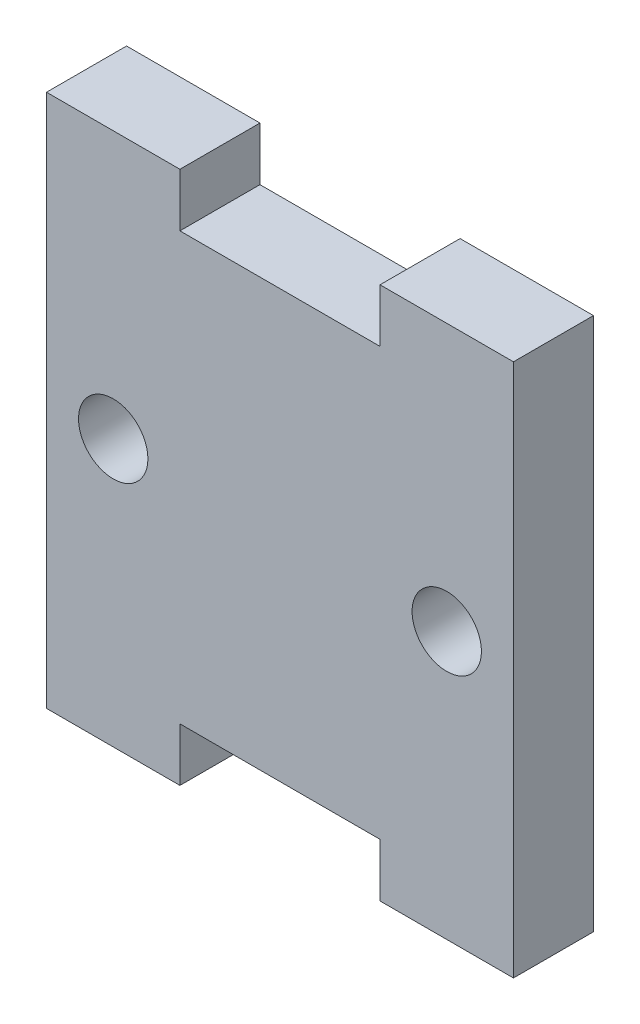
ISO-10303-21;
HEADER;
FILE_DESCRIPTION(('STEP AP214'),'2;1');
FILE_NAME('part.step','',(''),(''),'','','');
FILE_SCHEMA(('AUTOMOTIVE_DESIGN { 1 0 10303 214 1 1 1 1 }'));
ENDSEC;
DATA;
#1=APPLICATION_CONTEXT('core data for automotive mechanical design processes');
#2=APPLICATION_PROTOCOL_DEFINITION('international standard','automotive_design',2000,#1);
#3=PRODUCT_CONTEXT('',#1,'mechanical');
#4=PRODUCT('Part','Part','',(#3));
#5=PRODUCT_RELATED_PRODUCT_CATEGORY('part','',(#4));
#6=PRODUCT_DEFINITION_FORMATION('','',#4);
#7=PRODUCT_DEFINITION_CONTEXT('part definition',#1,'design');
#8=PRODUCT_DEFINITION('design','',#6,#7);
#9=PRODUCT_DEFINITION_SHAPE('','',#8);
#10=(LENGTH_UNIT() NAMED_UNIT(*) SI_UNIT(.MILLI.,.METRE.));
#11=(NAMED_UNIT(*) PLANE_ANGLE_UNIT() SI_UNIT($,.RADIAN.));
#12=(NAMED_UNIT(*) SI_UNIT($,.STERADIAN.) SOLID_ANGLE_UNIT());
#13=UNCERTAINTY_MEASURE_WITH_UNIT(LENGTH_MEASURE(1.E-05),#10,'distance_accuracy_value','');
#14=(GEOMETRIC_REPRESENTATION_CONTEXT(3) GLOBAL_UNCERTAINTY_ASSIGNED_CONTEXT((#13)) GLOBAL_UNIT_ASSIGNED_CONTEXT((#10,
#11,#12)) REPRESENTATION_CONTEXT('',''));
#15=CARTESIAN_POINT('',(0.,0.,0.));
#16=DIRECTION('',(0.,0.,1.));
#17=DIRECTION('',(1.,0.,0.));
#18=AXIS2_PLACEMENT_3D('',#15,#16,#17);
#19=CARTESIAN_POINT('',(-17.5,0.,6.));
#20=DIRECTION('',(-1.,0.,0.));
#21=DIRECTION('',(0.,0.,1.));
#22=AXIS2_PLACEMENT_3D('',#19,#20,#21);
#23=PLANE('',#22);
#24=DIRECTION('',(0.,1.,0.));
#25=VECTOR('',#24,1.);
#26=CARTESIAN_POINT('',(-17.5,0.,0.));
#27=LINE('',#26,#25);
#28=CARTESIAN_POINT('',(-17.5,-20.,0.));
#29=VERTEX_POINT('',#28);
#30=CARTESIAN_POINT('',(-17.5,20.,0.));
#31=VERTEX_POINT('',#30);
#32=EDGE_CURVE('E165',#29,#31,#27,.T.);
#33=ORIENTED_EDGE('',*,*,#32,.F.);
#34=DIRECTION('',(0.,0.,-1.));
#35=VECTOR('',#34,1.);
#36=CARTESIAN_POINT('',(-17.5,-20.,6.));
#37=LINE('',#36,#35);
#38=CARTESIAN_POINT('',(-17.5,-20.,6.));
#39=VERTEX_POINT('',#38);
#40=EDGE_CURVE('E11',#39,#29,#37,.T.);
#41=ORIENTED_EDGE('',*,*,#40,.F.);
#42=DIRECTION('',(0.,1.,0.));
#43=VECTOR('',#42,1.);
#44=CARTESIAN_POINT('',(-17.5,0.,6.));
#45=LINE('',#44,#43);
#46=CARTESIAN_POINT('',(-17.5,20.,6.));
#47=VERTEX_POINT('',#46);
#48=EDGE_CURVE('E201',#39,#47,#45,.T.);
#49=ORIENTED_EDGE('',*,*,#48,.T.);
#50=DIRECTION('',(0.,0.,-1.));
#51=VECTOR('',#50,1.);
#52=CARTESIAN_POINT('',(-17.5,20.,6.));
#53=LINE('',#52,#51);
#54=EDGE_CURVE('E103',#47,#31,#53,.T.);
#55=ORIENTED_EDGE('',*,*,#54,.T.);
#56=EDGE_LOOP('',(#33,#41,#49,#55));
#57=FACE_BOUND('',#56,.T.);
#58=ADVANCED_FACE('F41',(#57),#23,.T.);
#59=CARTESIAN_POINT('',(0.,-20.,6.));
#60=DIRECTION('',(0.,-1.,0.));
#61=DIRECTION('',(0.,0.,-1.));
#62=AXIS2_PLACEMENT_3D('',#59,#60,#61);
#63=PLANE('',#62);
#64=DIRECTION('',(-1.,0.,0.));
#65=VECTOR('',#64,1.);
#66=CARTESIAN_POINT('',(0.,-20.,0.));
#67=LINE('',#66,#65);
#68=CARTESIAN_POINT('',(-7.5,-20.,0.));
#69=VERTEX_POINT('',#68);
#70=EDGE_CURVE('E168',#69,#29,#67,.T.);
#71=ORIENTED_EDGE('',*,*,#70,.F.);
#72=DIRECTION('',(0.,0.,-1.));
#73=VECTOR('',#72,1.);
#74=CARTESIAN_POINT('',(-7.5,-20.,6.));
#75=LINE('',#74,#73);
#76=CARTESIAN_POINT('',(-7.5,-20.,6.));
#77=VERTEX_POINT('',#76);
#78=EDGE_CURVE('E49',#77,#69,#75,.T.);
#79=ORIENTED_EDGE('',*,*,#78,.F.);
#80=DIRECTION('',(-1.,0.,0.));
#81=VECTOR('',#80,1.);
#82=CARTESIAN_POINT('',(0.,-20.,6.));
#83=LINE('',#82,#81);
#84=EDGE_CURVE('E233',#77,#39,#83,.T.);
#85=ORIENTED_EDGE('',*,*,#84,.T.);
#86=ORIENTED_EDGE('',*,*,#40,.T.);
#87=EDGE_LOOP('',(#71,#79,#85,#86));
#88=FACE_BOUND('',#87,.T.);
#89=ADVANCED_FACE('F232',(#88),#63,.T.);
#90=CARTESIAN_POINT('',(-7.5,0.,6.));
#91=DIRECTION('',(-1.,0.,0.));
#92=DIRECTION('',(0.,0.,1.));
#93=AXIS2_PLACEMENT_3D('',#90,#91,#92);
#94=PLANE('',#93);
#95=DIRECTION('',(0.,1.,0.));
#96=VECTOR('',#95,1.);
#97=CARTESIAN_POINT('',(-7.5,0.,0.));
#98=LINE('',#97,#96);
#99=CARTESIAN_POINT('',(-7.5,-16.,0.));
#100=VERTEX_POINT('',#99);
#101=EDGE_CURVE('E171',#69,#100,#98,.T.);
#102=ORIENTED_EDGE('',*,*,#101,.T.);
#103=DIRECTION('',(0.,0.,-1.));
#104=VECTOR('',#103,1.);
#105=CARTESIAN_POINT('',(-7.5,-16.,6.));
#106=LINE('',#105,#104);
#107=CARTESIAN_POINT('',(-7.5,-16.,6.));
#108=VERTEX_POINT('',#107);
#109=EDGE_CURVE('E216',#108,#100,#106,.T.);
#110=ORIENTED_EDGE('',*,*,#109,.F.);
#111=DIRECTION('',(0.,1.,0.));
#112=VECTOR('',#111,1.);
#113=CARTESIAN_POINT('',(-7.5,0.,6.));
#114=LINE('',#113,#112);
#115=EDGE_CURVE('E223',#77,#108,#114,.T.);
#116=ORIENTED_EDGE('',*,*,#115,.F.);
#117=ORIENTED_EDGE('',*,*,#78,.T.);
#118=EDGE_LOOP('',(#102,#110,#116,#117));
#119=FACE_BOUND('',#118,.T.);
#120=ADVANCED_FACE('F221',(#119),#94,.F.);
#121=CARTESIAN_POINT('',(0.,-16.,6.));
#122=DIRECTION('',(0.,1.,0.));
#123=DIRECTION('',(0.,0.,1.));
#124=AXIS2_PLACEMENT_3D('',#121,#122,#123);
#125=PLANE('',#124);
#126=DIRECTION('',(1.,0.,0.));
#127=VECTOR('',#126,1.);
#128=CARTESIAN_POINT('',(0.,-16.,0.));
#129=LINE('',#128,#127);
#130=CARTESIAN_POINT('',(7.5,-16.,0.));
#131=VERTEX_POINT('',#130);
#132=EDGE_CURVE('E173',#100,#131,#129,.T.);
#133=ORIENTED_EDGE('',*,*,#132,.T.);
#134=DIRECTION('',(0.,0.,-1.));
#135=VECTOR('',#134,1.);
#136=CARTESIAN_POINT('',(7.5,-16.,6.));
#137=LINE('',#136,#135);
#138=CARTESIAN_POINT('',(7.5,-16.,6.));
#139=VERTEX_POINT('',#138);
#140=EDGE_CURVE('E214',#139,#131,#137,.T.);
#141=ORIENTED_EDGE('',*,*,#140,.F.);
#142=DIRECTION('',(1.,0.,0.));
#143=VECTOR('',#142,1.);
#144=CARTESIAN_POINT('',(0.,-16.,6.));
#145=LINE('',#144,#143);
#146=EDGE_CURVE('E239',#108,#139,#145,.T.);
#147=ORIENTED_EDGE('',*,*,#146,.F.);
#148=ORIENTED_EDGE('',*,*,#109,.T.);
#149=EDGE_LOOP('',(#133,#141,#147,#148));
#150=FACE_BOUND('',#149,.T.);
#151=ADVANCED_FACE('F280',(#150),#125,.F.);
#152=CARTESIAN_POINT('',(7.50000000000001,0.,6.));
#153=DIRECTION('',(-1.,0.,0.));
#154=DIRECTION('',(0.,-1.,0.));
#155=AXIS2_PLACEMENT_3D('',#152,#153,#154);
#156=PLANE('',#155);
#157=DIRECTION('',(0.,1.,0.));
#158=VECTOR('',#157,1.);
#159=CARTESIAN_POINT('',(7.50000000000001,0.,0.));
#160=LINE('',#159,#158);
#161=CARTESIAN_POINT('',(7.5,-20.,0.));
#162=VERTEX_POINT('',#161);
#163=EDGE_CURVE('E176',#162,#131,#160,.T.);
#164=ORIENTED_EDGE('',*,*,#163,.F.);
#165=DIRECTION('',(0.,0.,-1.));
#166=VECTOR('',#165,1.);
#167=CARTESIAN_POINT('',(7.5,-20.,6.));
#168=LINE('',#167,#166);
#169=CARTESIAN_POINT('',(7.5,-20.,6.));
#170=VERTEX_POINT('',#169);
#171=EDGE_CURVE('E212',#170,#162,#168,.T.);
#172=ORIENTED_EDGE('',*,*,#171,.F.);
#173=DIRECTION('',(0.,1.,0.));
#174=VECTOR('',#173,1.);
#175=CARTESIAN_POINT('',(7.50000000000001,0.,6.));
#176=LINE('',#175,#174);
#177=EDGE_CURVE('E241',#170,#139,#176,.T.);
#178=ORIENTED_EDGE('',*,*,#177,.T.);
#179=ORIENTED_EDGE('',*,*,#140,.T.);
#180=EDGE_LOOP('',(#164,#172,#178,#179));
#181=FACE_BOUND('',#180,.T.);
#182=ADVANCED_FACE('F285',(#181),#156,.T.);
#183=CARTESIAN_POINT('',(0.,-20.,6.));
#184=DIRECTION('',(0.,1.,0.));
#185=DIRECTION('',(0.,0.,1.));
#186=AXIS2_PLACEMENT_3D('',#183,#184,#185);
#187=PLANE('',#186);
#188=DIRECTION('',(1.,0.,0.));
#189=VECTOR('',#188,1.);
#190=CARTESIAN_POINT('',(0.,-20.,0.));
#191=LINE('',#190,#189);
#192=CARTESIAN_POINT('',(17.5,-20.,0.));
#193=VERTEX_POINT('',#192);
#194=EDGE_CURVE('E179',#162,#193,#191,.T.);
#195=ORIENTED_EDGE('',*,*,#194,.T.);
#196=DIRECTION('',(0.,0.,-1.));
#197=VECTOR('',#196,1.);
#198=CARTESIAN_POINT('',(17.5,-20.,6.));
#199=LINE('',#198,#197);
#200=CARTESIAN_POINT('',(17.5,-20.,6.));
#201=VERTEX_POINT('',#200);
#202=EDGE_CURVE('E209',#201,#193,#199,.T.);
#203=ORIENTED_EDGE('',*,*,#202,.F.);
#204=DIRECTION('',(1.,0.,0.));
#205=VECTOR('',#204,1.);
#206=CARTESIAN_POINT('',(0.,-20.,6.));
#207=LINE('',#206,#205);
#208=EDGE_CURVE('E244',#170,#201,#207,.T.);
#209=ORIENTED_EDGE('',*,*,#208,.F.);
#210=ORIENTED_EDGE('',*,*,#171,.T.);
#211=EDGE_LOOP('',(#195,#203,#209,#210));
#212=FACE_BOUND('',#211,.T.);
#213=ADVANCED_FACE('F289',(#212),#187,.F.);
#214=CARTESIAN_POINT('',(17.5,0.,6.));
#215=DIRECTION('',(-1.,0.,0.));
#216=DIRECTION('',(0.,0.,1.));
#217=AXIS2_PLACEMENT_3D('',#214,#215,#216);
#218=PLANE('',#217);
#219=DIRECTION('',(0.,1.,0.));
#220=VECTOR('',#219,1.);
#221=CARTESIAN_POINT('',(17.5,0.,0.));
#222=LINE('',#221,#220);
#223=CARTESIAN_POINT('',(17.5,20.,0.));
#224=VERTEX_POINT('',#223);
#225=EDGE_CURVE('E181',#193,#224,#222,.T.);
#226=ORIENTED_EDGE('',*,*,#225,.T.);
#227=DIRECTION('',(0.,0.,-1.));
#228=VECTOR('',#227,1.);
#229=CARTESIAN_POINT('',(17.5,20.,6.));
#230=LINE('',#229,#228);
#231=CARTESIAN_POINT('',(17.5,20.,6.));
#232=VERTEX_POINT('',#231);
#233=EDGE_CURVE('E207',#232,#224,#230,.T.);
#234=ORIENTED_EDGE('',*,*,#233,.F.);
#235=DIRECTION('',(0.,1.,0.));
#236=VECTOR('',#235,1.);
#237=CARTESIAN_POINT('',(17.5,0.,6.));
#238=LINE('',#237,#236);
#239=EDGE_CURVE('E246',#201,#232,#238,.T.);
#240=ORIENTED_EDGE('',*,*,#239,.F.);
#241=ORIENTED_EDGE('',*,*,#202,.T.);
#242=EDGE_LOOP('',(#226,#234,#240,#241));
#243=FACE_BOUND('',#242,.T.);
#244=ADVANCED_FACE('F259',(#243),#218,.F.);
#245=CARTESIAN_POINT('',(0.,20.,6.));
#246=DIRECTION('',(0.,1.,0.));
#247=DIRECTION('',(-1.,0.,0.));
#248=AXIS2_PLACEMENT_3D('',#245,#246,#247);
#249=PLANE('',#248);
#250=DIRECTION('',(1.,0.,0.));
#251=VECTOR('',#250,1.);
#252=CARTESIAN_POINT('',(0.,20.,0.));
#253=LINE('',#252,#251);
#254=CARTESIAN_POINT('',(7.49999999999999,20.,0.));
#255=VERTEX_POINT('',#254);
#256=EDGE_CURVE('E184',#255,#224,#253,.T.);
#257=ORIENTED_EDGE('',*,*,#256,.F.);
#258=DIRECTION('',(0.,0.,-1.));
#259=VECTOR('',#258,1.);
#260=CARTESIAN_POINT('',(7.49999999999999,20.,6.));
#261=LINE('',#260,#259);
#262=CARTESIAN_POINT('',(7.49999999999999,20.,6.));
#263=VERTEX_POINT('',#262);
#264=EDGE_CURVE('E205',#263,#255,#261,.T.);
#265=ORIENTED_EDGE('',*,*,#264,.F.);
#266=DIRECTION('',(1.,0.,0.));
#267=VECTOR('',#266,1.);
#268=CARTESIAN_POINT('',(0.,20.,6.));
#269=LINE('',#268,#267);
#270=EDGE_CURVE('E248',#263,#232,#269,.T.);
#271=ORIENTED_EDGE('',*,*,#270,.T.);
#272=ORIENTED_EDGE('',*,*,#233,.T.);
#273=EDGE_LOOP('',(#257,#265,#271,#272));
#274=FACE_BOUND('',#273,.T.);
#275=ADVANCED_FACE('F252',(#274),#249,.T.);
#276=CARTESIAN_POINT('',(7.50000000000001,0.,6.));
#277=DIRECTION('',(1.,0.,0.));
#278=DIRECTION('',(0.,1.,0.));
#279=AXIS2_PLACEMENT_3D('',#276,#277,#278);
#280=PLANE('',#279);
#281=DIRECTION('',(0.,-1.,0.));
#282=VECTOR('',#281,1.);
#283=CARTESIAN_POINT('',(7.50000000000001,0.,0.));
#284=LINE('',#283,#282);
#285=CARTESIAN_POINT('',(7.5,16.,0.));
#286=VERTEX_POINT('',#285);
#287=EDGE_CURVE('E187',#255,#286,#284,.T.);
#288=ORIENTED_EDGE('',*,*,#287,.T.);
#289=DIRECTION('',(0.,0.,-1.));
#290=VECTOR('',#289,1.);
#291=CARTESIAN_POINT('',(7.5,16.,6.));
#292=LINE('',#291,#290);
#293=CARTESIAN_POINT('',(7.5,16.,6.));
#294=VERTEX_POINT('',#293);
#295=EDGE_CURVE('E144',#294,#286,#292,.T.);
#296=ORIENTED_EDGE('',*,*,#295,.F.);
#297=DIRECTION('',(0.,-1.,0.));
#298=VECTOR('',#297,1.);
#299=CARTESIAN_POINT('',(7.50000000000001,0.,6.));
#300=LINE('',#299,#298);
#301=EDGE_CURVE('E151',#263,#294,#300,.T.);
#302=ORIENTED_EDGE('',*,*,#301,.F.);
#303=ORIENTED_EDGE('',*,*,#264,.T.);
#304=EDGE_LOOP('',(#288,#296,#302,#303));
#305=FACE_BOUND('',#304,.T.);
#306=ADVANCED_FACE('F264',(#305),#280,.F.);
#307=CARTESIAN_POINT('',(0.,16.,6.));
#308=DIRECTION('',(0.,1.,0.));
#309=DIRECTION('',(0.,0.,1.));
#310=AXIS2_PLACEMENT_3D('',#307,#308,#309);
#311=PLANE('',#310);
#312=DIRECTION('',(1.,0.,0.));
#313=VECTOR('',#312,1.);
#314=CARTESIAN_POINT('',(0.,16.,0.));
#315=LINE('',#314,#313);
#316=CARTESIAN_POINT('',(-7.5,16.,0.));
#317=VERTEX_POINT('',#316);
#318=EDGE_CURVE('E139',#317,#286,#315,.T.);
#319=ORIENTED_EDGE('',*,*,#318,.F.);
#320=DIRECTION('',(0.,0.,-1.));
#321=VECTOR('',#320,1.);
#322=CARTESIAN_POINT('',(-7.5,16.,6.));
#323=LINE('',#322,#321);
#324=CARTESIAN_POINT('',(-7.5,16.,6.));
#325=VERTEX_POINT('',#324);
#326=EDGE_CURVE('E134',#325,#317,#323,.T.);
#327=ORIENTED_EDGE('',*,*,#326,.F.);
#328=DIRECTION('',(1.,0.,0.));
#329=VECTOR('',#328,1.);
#330=CARTESIAN_POINT('',(0.,16.,6.));
#331=LINE('',#330,#329);
#332=EDGE_CURVE('E137',#325,#294,#331,.T.);
#333=ORIENTED_EDGE('',*,*,#332,.T.);
#334=ORIENTED_EDGE('',*,*,#295,.T.);
#335=EDGE_LOOP('',(#319,#327,#333,#334));
#336=FACE_BOUND('',#335,.T.);
#337=ADVANCED_FACE('F136',(#336),#311,.T.);
#338=CARTESIAN_POINT('',(-7.5,0.,6.));
#339=DIRECTION('',(1.,0.,0.));
#340=DIRECTION('',(0.,1.,0.));
#341=AXIS2_PLACEMENT_3D('',#338,#339,#340);
#342=PLANE('',#341);
#343=DIRECTION('',(0.,-1.,0.));
#344=VECTOR('',#343,1.);
#345=CARTESIAN_POINT('',(-7.5,0.,0.));
#346=LINE('',#345,#344);
#347=CARTESIAN_POINT('',(-7.50000000000001,20.,0.));
#348=VERTEX_POINT('',#347);
#349=EDGE_CURVE('E191',#348,#317,#346,.T.);
#350=ORIENTED_EDGE('',*,*,#349,.F.);
#351=DIRECTION('',(0.,0.,-1.));
#352=VECTOR('',#351,1.);
#353=CARTESIAN_POINT('',(-7.50000000000001,20.,6.));
#354=LINE('',#353,#352);
#355=CARTESIAN_POINT('',(-7.50000000000001,20.,6.));
#356=VERTEX_POINT('',#355);
#357=EDGE_CURVE('E96',#356,#348,#354,.T.);
#358=ORIENTED_EDGE('',*,*,#357,.F.);
#359=DIRECTION('',(0.,-1.,0.));
#360=VECTOR('',#359,1.);
#361=CARTESIAN_POINT('',(-7.5,0.,6.));
#362=LINE('',#361,#360);
#363=EDGE_CURVE('E148',#356,#325,#362,.T.);
#364=ORIENTED_EDGE('',*,*,#363,.T.);
#365=ORIENTED_EDGE('',*,*,#326,.T.);
#366=EDGE_LOOP('',(#350,#358,#364,#365));
#367=FACE_BOUND('',#366,.T.);
#368=ADVANCED_FACE('F154',(#367),#342,.T.);
#369=CARTESIAN_POINT('',(-12.5,0.,6.));
#370=DIRECTION('',(0.,0.,-1.));
#371=DIRECTION('',(-1.,0.,0.));
#372=AXIS2_PLACEMENT_3D('',#369,#370,#371);
#373=CYLINDRICAL_SURFACE('',#372,2.6);
#374=CARTESIAN_POINT('',(-12.5,0.,6.));
#375=DIRECTION('',(0.,0.,1.));
#376=DIRECTION('',(1.,0.,0.));
#377=AXIS2_PLACEMENT_3D('',#374,#375,#376);
#378=CIRCLE('',#377,2.6);
#379=CARTESIAN_POINT('',(-9.9,0.,6.));
#380=VERTEX_POINT('',#379);
#381=EDGE_CURVE('E156',#380,#380,#378,.T.);
#382=ORIENTED_EDGE('',*,*,#381,.T.);
#383=EDGE_LOOP('',(#382));
#384=FACE_BOUND('',#383,.T.);
#385=CARTESIAN_POINT('',(-12.5,0.,0.));
#386=DIRECTION('',(0.,0.,1.));
#387=DIRECTION('',(1.,0.,0.));
#388=AXIS2_PLACEMENT_3D('',#385,#386,#387);
#389=CIRCLE('',#388,2.6);
#390=CARTESIAN_POINT('',(-9.9,0.,0.));
#391=VERTEX_POINT('',#390);
#392=EDGE_CURVE('E195',#391,#391,#389,.T.);
#393=ORIENTED_EDGE('',*,*,#392,.F.);
#394=EDGE_LOOP('',(#393));
#395=FACE_BOUND('',#394,.T.);
#396=ADVANCED_FACE('F324',(#384,#395),#373,.F.);
#397=CARTESIAN_POINT('',(0.,20.,6.));
#398=DIRECTION('',(0.,-1.,0.));
#399=DIRECTION('',(1.,0.,0.));
#400=AXIS2_PLACEMENT_3D('',#397,#398,#399);
#401=PLANE('',#400);
#402=DIRECTION('',(-1.,0.,0.));
#403=VECTOR('',#402,1.);
#404=CARTESIAN_POINT('',(0.,20.,0.));
#405=LINE('',#404,#403);
#406=EDGE_CURVE('E193',#348,#31,#405,.T.);
#407=ORIENTED_EDGE('',*,*,#406,.T.);
#408=ORIENTED_EDGE('',*,*,#54,.F.);
#409=DIRECTION('',(-1.,0.,0.));
#410=VECTOR('',#409,1.);
#411=CARTESIAN_POINT('',(0.,20.,6.));
#412=LINE('',#411,#410);
#413=EDGE_CURVE('E57',#356,#47,#412,.T.);
#414=ORIENTED_EDGE('',*,*,#413,.F.);
#415=ORIENTED_EDGE('',*,*,#357,.T.);
#416=EDGE_LOOP('',(#407,#408,#414,#415));
#417=FACE_BOUND('',#416,.T.);
#418=ADVANCED_FACE('F234',(#417),#401,.F.);
#419=CARTESIAN_POINT('',(12.5,0.,6.));
#420=DIRECTION('',(0.,0.,-1.));
#421=DIRECTION('',(-1.,0.,0.));
#422=AXIS2_PLACEMENT_3D('',#419,#420,#421);
#423=CYLINDRICAL_SURFACE('',#422,2.6);
#424=CARTESIAN_POINT('',(12.5,0.,6.));
#425=DIRECTION('',(0.,0.,1.));
#426=DIRECTION('',(1.,0.,0.));
#427=AXIS2_PLACEMENT_3D('',#424,#425,#426);
#428=CIRCLE('',#427,2.6);
#429=CARTESIAN_POINT('',(15.1,0.,6.));
#430=VERTEX_POINT('',#429);
#431=EDGE_CURVE('E162',#430,#430,#428,.F.);
#432=ORIENTED_EDGE('',*,*,#431,.F.);
#433=EDGE_LOOP('',(#432));
#434=FACE_BOUND('',#433,.T.);
#435=CARTESIAN_POINT('',(12.5,0.,0.));
#436=DIRECTION('',(0.,0.,1.));
#437=DIRECTION('',(1.,0.,0.));
#438=AXIS2_PLACEMENT_3D('',#435,#436,#437);
#439=CIRCLE('',#438,2.6);
#440=CARTESIAN_POINT('',(15.1,0.,0.));
#441=VERTEX_POINT('',#440);
#442=EDGE_CURVE('E198',#441,#441,#439,.F.);
#443=ORIENTED_EDGE('',*,*,#442,.T.);
#444=EDGE_LOOP('',(#443));
#445=FACE_BOUND('',#444,.T.);
#446=ADVANCED_FACE('F342',(#434,#445),#423,.F.);
#447=CARTESIAN_POINT('',(0.,0.,6.));
#448=DIRECTION('',(0.,0.,1.));
#449=DIRECTION('',(1.,0.,0.));
#450=AXIS2_PLACEMENT_3D('',#447,#448,#449);
#451=PLANE('',#450);
#452=ORIENTED_EDGE('',*,*,#48,.F.);
#453=ORIENTED_EDGE('',*,*,#84,.F.);
#454=ORIENTED_EDGE('',*,*,#115,.T.);
#455=ORIENTED_EDGE('',*,*,#146,.T.);
#456=ORIENTED_EDGE('',*,*,#177,.F.);
#457=ORIENTED_EDGE('',*,*,#208,.T.);
#458=ORIENTED_EDGE('',*,*,#239,.T.);
#459=ORIENTED_EDGE('',*,*,#270,.F.);
#460=ORIENTED_EDGE('',*,*,#301,.T.);
#461=ORIENTED_EDGE('',*,*,#332,.F.);
#462=ORIENTED_EDGE('',*,*,#363,.F.);
#463=ORIENTED_EDGE('',*,*,#413,.T.);
#464=EDGE_LOOP('',(#452,#453,#454,#455,#456,#457,#458,#459,#460,#461,#462,#463));
#465=FACE_BOUND('',#464,.T.);
#466=ORIENTED_EDGE('',*,*,#381,.F.);
#467=EDGE_LOOP('',(#466));
#468=FACE_BOUND('',#467,.T.);
#469=ORIENTED_EDGE('',*,*,#431,.T.);
#470=EDGE_LOOP('',(#469));
#471=FACE_BOUND('',#470,.T.);
#472=ADVANCED_FACE('F146',(#465,#468,#471),#451,.T.);
#473=CARTESIAN_POINT('',(0.,0.,0.));
#474=DIRECTION('',(0.,0.,1.));
#475=DIRECTION('',(1.,0.,0.));
#476=AXIS2_PLACEMENT_3D('',#473,#474,#475);
#477=PLANE('',#476);
#478=ORIENTED_EDGE('',*,*,#32,.T.);
#479=ORIENTED_EDGE('',*,*,#406,.F.);
#480=ORIENTED_EDGE('',*,*,#349,.T.);
#481=ORIENTED_EDGE('',*,*,#318,.T.);
#482=ORIENTED_EDGE('',*,*,#287,.F.);
#483=ORIENTED_EDGE('',*,*,#256,.T.);
#484=ORIENTED_EDGE('',*,*,#225,.F.);
#485=ORIENTED_EDGE('',*,*,#194,.F.);
#486=ORIENTED_EDGE('',*,*,#163,.T.);
#487=ORIENTED_EDGE('',*,*,#132,.F.);
#488=ORIENTED_EDGE('',*,*,#101,.F.);
#489=ORIENTED_EDGE('',*,*,#70,.T.);
#490=EDGE_LOOP('',(#478,#479,#480,#481,#482,#483,#484,#485,#486,#487,#488,#489));
#491=FACE_BOUND('',#490,.T.);
#492=ORIENTED_EDGE('',*,*,#392,.T.);
#493=EDGE_LOOP('',(#492));
#494=FACE_BOUND('',#493,.T.);
#495=ORIENTED_EDGE('',*,*,#442,.F.);
#496=EDGE_LOOP('',(#495));
#497=FACE_BOUND('',#496,.T.);
#498=ADVANCED_FACE('F230',(#491,#494,#497),#477,.F.);
#499=CLOSED_SHELL('',(#58,#89,#120,#151,#182,#213,#244,#275,#306,#337,#368,#396,#418,#446,#472,#498));
#500=MANIFOLD_SOLID_BREP('B2',#499);
#501=ADVANCED_BREP_SHAPE_REPRESENTATION('',(#18,#500),#14);
#502=SHAPE_DEFINITION_REPRESENTATION(#9,#501);
ENDSEC;
END-ISO-10303-21;
